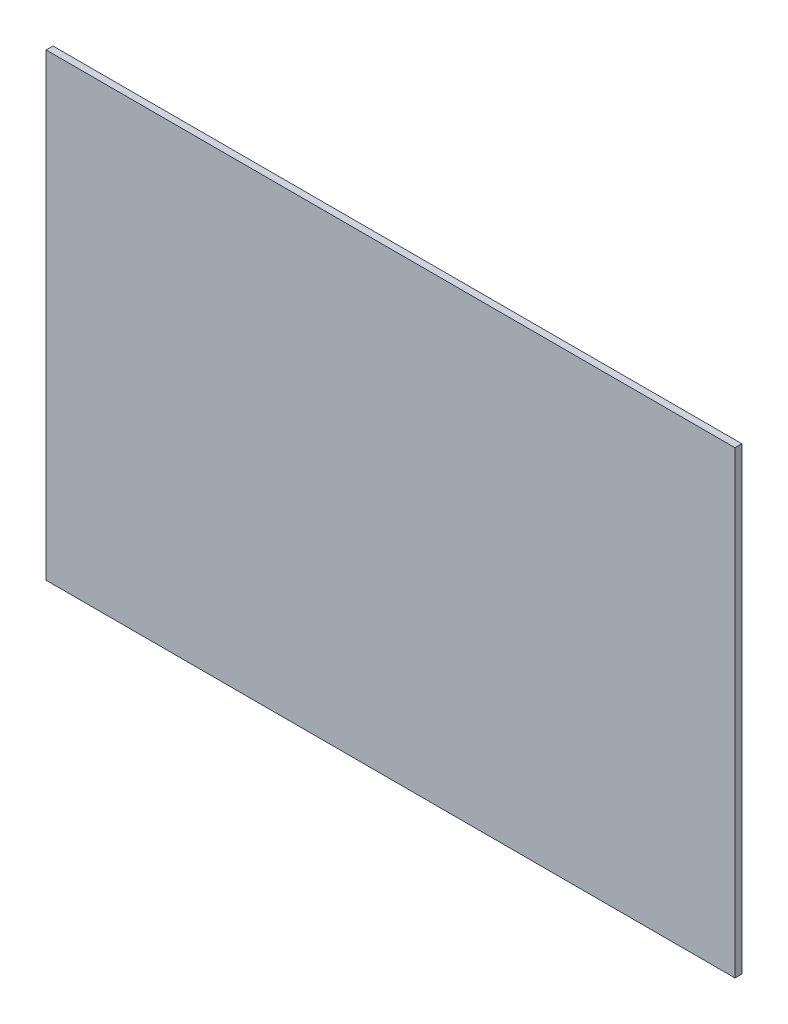
ISO-10303-21;
HEADER;
FILE_DESCRIPTION(('STEP AP214'),'2;1');
FILE_NAME('part.step','',(''),(''),'','','');
FILE_SCHEMA(('AUTOMOTIVE_DESIGN { 1 0 10303 214 1 1 1 1 }'));
ENDSEC;
DATA;
#1=APPLICATION_CONTEXT('core data for automotive mechanical design processes');
#2=APPLICATION_PROTOCOL_DEFINITION('international standard','automotive_design',2000,#1);
#3=PRODUCT_CONTEXT('',#1,'mechanical');
#4=PRODUCT('Part','Part','',(#3));
#5=PRODUCT_RELATED_PRODUCT_CATEGORY('part','',(#4));
#6=PRODUCT_DEFINITION_FORMATION('','',#4);
#7=PRODUCT_DEFINITION_CONTEXT('part definition',#1,'design');
#8=PRODUCT_DEFINITION('design','',#6,#7);
#9=PRODUCT_DEFINITION_SHAPE('','',#8);
#10=(LENGTH_UNIT() NAMED_UNIT(*) SI_UNIT(.MILLI.,.METRE.));
#11=(NAMED_UNIT(*) PLANE_ANGLE_UNIT() SI_UNIT($,.RADIAN.));
#12=(NAMED_UNIT(*) SI_UNIT($,.STERADIAN.) SOLID_ANGLE_UNIT());
#13=UNCERTAINTY_MEASURE_WITH_UNIT(LENGTH_MEASURE(1.E-05),#10,'distance_accuracy_value','');
#14=(GEOMETRIC_REPRESENTATION_CONTEXT(3) GLOBAL_UNCERTAINTY_ASSIGNED_CONTEXT((#13)) GLOBAL_UNIT_ASSIGNED_CONTEXT((#10,
#11,#12)) REPRESENTATION_CONTEXT('',''));
#15=CARTESIAN_POINT('',(0.,0.,0.));
#16=DIRECTION('',(0.,0.,1.));
#17=DIRECTION('',(1.,0.,0.));
#18=AXIS2_PLACEMENT_3D('',#15,#16,#17);
#19=CARTESIAN_POINT('',(-59.5482845023795,184.807037037037,3.));
#20=DIRECTION('',(1.,0.,0.));
#21=DIRECTION('',(0.,1.,0.));
#22=AXIS2_PLACEMENT_3D('',#19,#20,#21);
#23=PLANE('',#22);
#24=DIRECTION('',(0.,-1.,0.));
#25=VECTOR('',#24,1.);
#26=CARTESIAN_POINT('',(-59.5482845023795,184.807037037037,0.));
#27=LINE('',#26,#25);
#28=CARTESIAN_POINT('',(-59.5482845023795,184.807037037037,0.));
#29=VERTEX_POINT('',#28);
#30=CARTESIAN_POINT('',(-59.5482845023795,-15.192962962963,0.));
#31=VERTEX_POINT('',#30);
#32=EDGE_CURVE('E96',#29,#31,#27,.T.);
#33=ORIENTED_EDGE('',*,*,#32,.T.);
#34=DIRECTION('',(0.,0.,-1.));
#35=VECTOR('',#34,1.);
#36=CARTESIAN_POINT('',(-59.5482845023795,-15.192962962963,3.));
#37=LINE('',#36,#35);
#38=CARTESIAN_POINT('',(-59.5482845023795,-15.192962962963,3.));
#39=VERTEX_POINT('',#38);
#40=EDGE_CURVE('E11',#39,#31,#37,.T.);
#41=ORIENTED_EDGE('',*,*,#40,.F.);
#42=DIRECTION('',(0.,-1.,0.));
#43=VECTOR('',#42,1.);
#44=CARTESIAN_POINT('',(-59.5482845023795,184.807037037037,3.));
#45=LINE('',#44,#43);
#46=CARTESIAN_POINT('',(-59.5482845023795,184.807037037037,3.));
#47=VERTEX_POINT('',#46);
#48=EDGE_CURVE('E84',#47,#39,#45,.T.);
#49=ORIENTED_EDGE('',*,*,#48,.F.);
#50=DIRECTION('',(0.,0.,-1.));
#51=VECTOR('',#50,1.);
#52=CARTESIAN_POINT('',(-59.5482845023795,184.807037037037,3.));
#53=LINE('',#52,#51);
#54=EDGE_CURVE('E92',#47,#29,#53,.T.);
#55=ORIENTED_EDGE('',*,*,#54,.T.);
#56=EDGE_LOOP('',(#33,#41,#49,#55));
#57=FACE_BOUND('',#56,.T.);
#58=ADVANCED_FACE('F33',(#57),#23,.F.);
#59=CARTESIAN_POINT('',(-59.5482845023795,-15.192962962963,3.));
#60=DIRECTION('',(0.,1.,0.));
#61=DIRECTION('',(0.,0.,1.));
#62=AXIS2_PLACEMENT_3D('',#59,#60,#61);
#63=PLANE('',#62);
#64=DIRECTION('',(1.,0.,0.));
#65=VECTOR('',#64,1.);
#66=CARTESIAN_POINT('',(-59.5482845023795,-15.192962962963,0.));
#67=LINE('',#66,#65);
#68=CARTESIAN_POINT('',(240.451715497621,-15.192962962963,0.));
#69=VERTEX_POINT('',#68);
#70=EDGE_CURVE('E88',#31,#69,#67,.T.);
#71=ORIENTED_EDGE('',*,*,#70,.T.);
#72=DIRECTION('',(0.,0.,-1.));
#73=VECTOR('',#72,1.);
#74=CARTESIAN_POINT('',(240.451715497621,-15.192962962963,3.));
#75=LINE('',#74,#73);
#76=CARTESIAN_POINT('',(240.451715497621,-15.192962962963,3.));
#77=VERTEX_POINT('',#76);
#78=EDGE_CURVE('E41',#77,#69,#75,.T.);
#79=ORIENTED_EDGE('',*,*,#78,.F.);
#80=DIRECTION('',(1.,0.,0.));
#81=VECTOR('',#80,1.);
#82=CARTESIAN_POINT('',(-59.5482845023795,-15.192962962963,3.));
#83=LINE('',#82,#81);
#84=EDGE_CURVE('E79',#39,#77,#83,.T.);
#85=ORIENTED_EDGE('',*,*,#84,.F.);
#86=ORIENTED_EDGE('',*,*,#40,.T.);
#87=EDGE_LOOP('',(#71,#79,#85,#86));
#88=FACE_BOUND('',#87,.T.);
#89=ADVANCED_FACE('F87',(#88),#63,.F.);
#90=CARTESIAN_POINT('',(240.45171549762,184.807037037037,3.));
#91=DIRECTION('',(-1.,0.,0.));
#92=DIRECTION('',(0.,-1.,0.));
#93=AXIS2_PLACEMENT_3D('',#90,#91,#92);
#94=PLANE('',#93);
#95=DIRECTION('',(0.,1.,0.));
#96=VECTOR('',#95,1.);
#97=CARTESIAN_POINT('',(240.45171549762,184.807037037037,0.));
#98=LINE('',#97,#96);
#99=CARTESIAN_POINT('',(240.45171549762,184.807037037037,0.));
#100=VERTEX_POINT('',#99);
#101=EDGE_CURVE('E66',#69,#100,#98,.T.);
#102=ORIENTED_EDGE('',*,*,#101,.T.);
#103=DIRECTION('',(0.,0.,-1.));
#104=VECTOR('',#103,1.);
#105=CARTESIAN_POINT('',(240.45171549762,184.807037037037,3.));
#106=LINE('',#105,#104);
#107=CARTESIAN_POINT('',(240.45171549762,184.807037037037,3.));
#108=VERTEX_POINT('',#107);
#109=EDGE_CURVE('E89',#108,#100,#106,.T.);
#110=ORIENTED_EDGE('',*,*,#109,.F.);
#111=DIRECTION('',(0.,1.,0.));
#112=VECTOR('',#111,1.);
#113=CARTESIAN_POINT('',(240.45171549762,184.807037037037,3.));
#114=LINE('',#113,#112);
#115=EDGE_CURVE('E82',#77,#108,#114,.T.);
#116=ORIENTED_EDGE('',*,*,#115,.F.);
#117=ORIENTED_EDGE('',*,*,#78,.T.);
#118=EDGE_LOOP('',(#102,#110,#116,#117));
#119=FACE_BOUND('',#118,.T.);
#120=ADVANCED_FACE('F90',(#119),#94,.F.);
#121=CARTESIAN_POINT('',(-59.5482845023795,184.807037037037,3.));
#122=DIRECTION('',(0.,-1.,0.));
#123=DIRECTION('',(0.,0.,-1.));
#124=AXIS2_PLACEMENT_3D('',#121,#122,#123);
#125=PLANE('',#124);
#126=DIRECTION('',(-1.,0.,0.));
#127=VECTOR('',#126,1.);
#128=CARTESIAN_POINT('',(-59.5482845023795,184.807037037037,0.));
#129=LINE('',#128,#127);
#130=EDGE_CURVE('E72',#100,#29,#129,.T.);
#131=ORIENTED_EDGE('',*,*,#130,.T.);
#132=ORIENTED_EDGE('',*,*,#54,.F.);
#133=DIRECTION('',(-1.,0.,0.));
#134=VECTOR('',#133,1.);
#135=CARTESIAN_POINT('',(-59.5482845023795,184.807037037037,3.));
#136=LINE('',#135,#134);
#137=EDGE_CURVE('E49',#108,#47,#136,.T.);
#138=ORIENTED_EDGE('',*,*,#137,.F.);
#139=ORIENTED_EDGE('',*,*,#109,.T.);
#140=EDGE_LOOP('',(#131,#132,#138,#139));
#141=FACE_BOUND('',#140,.T.);
#142=ADVANCED_FACE('F103',(#141),#125,.F.);
#143=CARTESIAN_POINT('',(0.,0.,3.));
#144=DIRECTION('',(0.,0.,1.));
#145=DIRECTION('',(1.,0.,0.));
#146=AXIS2_PLACEMENT_3D('',#143,#144,#145);
#147=PLANE('',#146);
#148=ORIENTED_EDGE('',*,*,#48,.T.);
#149=ORIENTED_EDGE('',*,*,#84,.T.);
#150=ORIENTED_EDGE('',*,*,#115,.T.);
#151=ORIENTED_EDGE('',*,*,#137,.T.);
#152=EDGE_LOOP('',(#148,#149,#150,#151));
#153=FACE_BOUND('',#152,.T.);
#154=ADVANCED_FACE('F80',(#153),#147,.T.);
#155=CARTESIAN_POINT('',(0.,0.,0.));
#156=DIRECTION('',(0.,0.,1.));
#157=DIRECTION('',(1.,0.,0.));
#158=AXIS2_PLACEMENT_3D('',#155,#156,#157);
#159=PLANE('',#158);
#160=ORIENTED_EDGE('',*,*,#32,.F.);
#161=ORIENTED_EDGE('',*,*,#130,.F.);
#162=ORIENTED_EDGE('',*,*,#101,.F.);
#163=ORIENTED_EDGE('',*,*,#70,.F.);
#164=EDGE_LOOP('',(#160,#161,#162,#163));
#165=FACE_BOUND('',#164,.T.);
#166=ADVANCED_FACE('F106',(#165),#159,.F.);
#167=CLOSED_SHELL('',(#58,#89,#120,#142,#154,#166));
#168=MANIFOLD_SOLID_BREP('B2',#167);
#169=ADVANCED_BREP_SHAPE_REPRESENTATION('',(#18,#168),#14);
#170=SHAPE_DEFINITION_REPRESENTATION(#9,#169);
ENDSEC;
END-ISO-10303-21;
